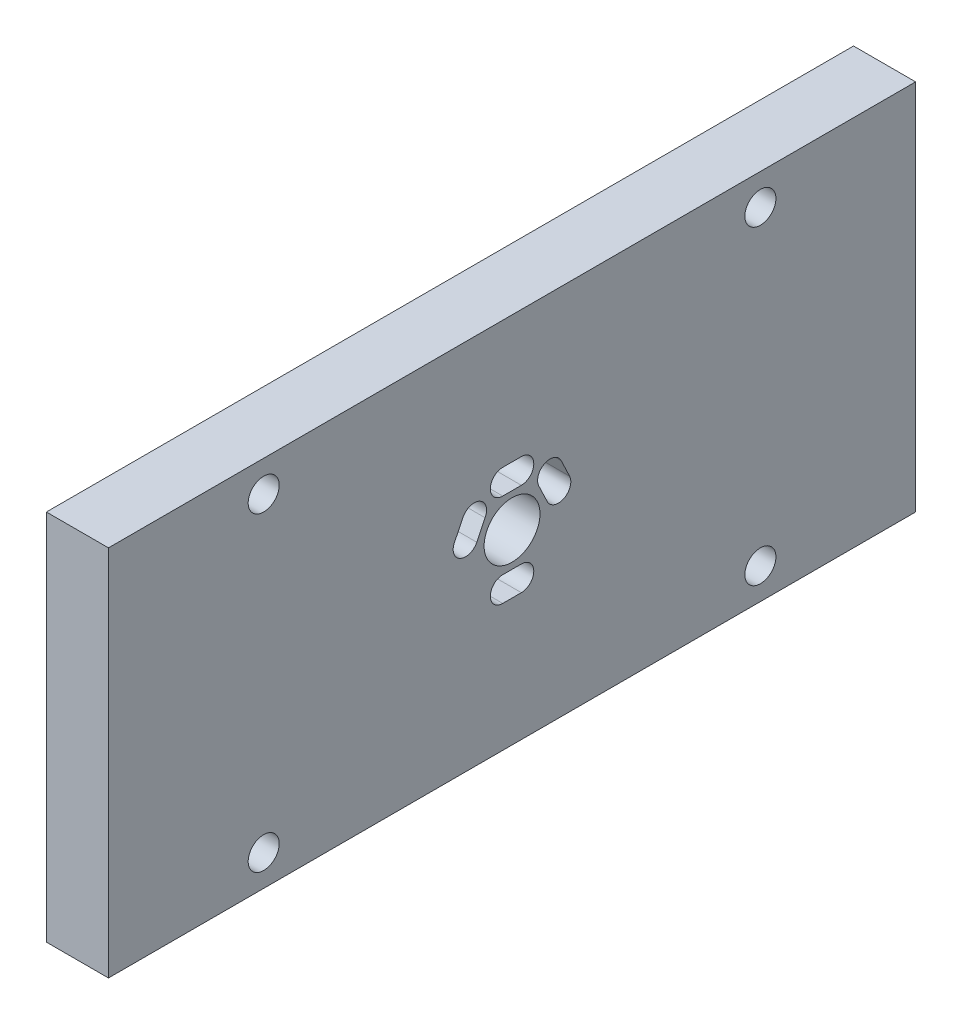
ISO-10303-21;
HEADER;
FILE_DESCRIPTION(('STEP AP214'),'2;1');
FILE_NAME('part.step','',(''),(''),'','','');
FILE_SCHEMA(('AUTOMOTIVE_DESIGN { 1 0 10303 214 1 1 1 1 }'));
ENDSEC;
DATA;
#1=APPLICATION_CONTEXT('core data for automotive mechanical design processes');
#2=APPLICATION_PROTOCOL_DEFINITION('international standard','automotive_design',2000,#1);
#3=PRODUCT_CONTEXT('',#1,'mechanical');
#4=PRODUCT('Part','Part','',(#3));
#5=PRODUCT_RELATED_PRODUCT_CATEGORY('part','',(#4));
#6=PRODUCT_DEFINITION_FORMATION('','',#4);
#7=PRODUCT_DEFINITION_CONTEXT('part definition',#1,'design');
#8=PRODUCT_DEFINITION('design','',#6,#7);
#9=PRODUCT_DEFINITION_SHAPE('','',#8);
#10=(LENGTH_UNIT() NAMED_UNIT(*) SI_UNIT(.MILLI.,.METRE.));
#11=(NAMED_UNIT(*) PLANE_ANGLE_UNIT() SI_UNIT($,.RADIAN.));
#12=(NAMED_UNIT(*) SI_UNIT($,.STERADIAN.) SOLID_ANGLE_UNIT());
#13=UNCERTAINTY_MEASURE_WITH_UNIT(LENGTH_MEASURE(1.E-05),#10,'distance_accuracy_value','');
#14=(GEOMETRIC_REPRESENTATION_CONTEXT(3) GLOBAL_UNCERTAINTY_ASSIGNED_CONTEXT((#13)) GLOBAL_UNIT_ASSIGNED_CONTEXT((#10,
#11,#12)) REPRESENTATION_CONTEXT('',''));
#15=CARTESIAN_POINT('',(0.,0.,0.));
#16=DIRECTION('',(0.,0.,1.));
#17=DIRECTION('',(1.,0.,0.));
#18=AXIS2_PLACEMENT_3D('',#15,#16,#17);
#19=CARTESIAN_POINT('',(10.,0.,0.));
#20=DIRECTION('',(1.,0.,0.));
#21=DIRECTION('',(0.,0.,-1.));
#22=AXIS2_PLACEMENT_3D('',#19,#20,#21);
#23=PLANE('',#22);
#24=DIRECTION('',(0.,0.902649656090385,0.430376112673449));
#25=VECTOR('',#24,1.);
#26=CARTESIAN_POINT('',(10.,33.5893000538088,-11.7336326254633));
#27=LINE('',#26,#25);
#28=CARTESIAN_POINT('',(10.,30.7583147353488,-13.0834237079433));
#29=VERTEX_POINT('',#28);
#30=CARTESIAN_POINT('',(10.,33.5893000538088,-11.7336326254633));
#31=VERTEX_POINT('',#30);
#32=EDGE_CURVE('E177',#29,#31,#27,.T.);
#33=ORIENTED_EDGE('',*,*,#32,.F.);
#34=CARTESIAN_POINT('',(10.,29.8982601486518,-11.277710689953));
#35=DIRECTION('',(1.,0.,0.));
#36=DIRECTION('',(0.,0.,-1.));
#37=AXIS2_PLACEMENT_3D('',#34,#35,#36);
#38=CIRCLE('',#37,2.00007334751453);
#39=CARTESIAN_POINT('',(10.,29.0382055619547,-9.47199767196282));
#40=VERTEX_POINT('',#39);
#41=EDGE_CURVE('E169',#40,#29,#38,.T.);
#42=ORIENTED_EDGE('',*,*,#41,.F.);
#43=DIRECTION('',(0.,-0.902996994662955,-0.429646863865747));
#44=VECTOR('',#43,1.);
#45=CARTESIAN_POINT('',(10.,29.0382055619547,-9.47199767196282));
#46=LINE('',#45,#44);
#47=CARTESIAN_POINT('',(10.,31.9615961769347,-8.08104552372279));
#48=VERTEX_POINT('',#47);
#49=EDGE_CURVE('E192',#48,#40,#46,.T.);
#50=ORIENTED_EDGE('',*,*,#49,.F.);
#51=CARTESIAN_POINT('',(10.,32.7289545054334,-9.92805804091433));
#52=DIRECTION('',(1.,0.,0.));
#53=DIRECTION('',(0.,0.,-1.));
#54=AXIS2_PLACEMENT_3D('',#51,#52,#53);
#55=CIRCLE('',#54,2.00007350939372);
#56=EDGE_CURVE('E190',#31,#48,#55,.T.);
#57=ORIENTED_EDGE('',*,*,#56,.F.);
#58=EDGE_LOOP('',(#33,#42,#50,#57));
#59=FACE_BOUND('',#58,.T.);
#60=DIRECTION('',(0.,0.,1.));
#61=VECTOR('',#60,1.);
#62=CARTESIAN_POINT('',(10.,22.3975308727947,-2.3131607907828));
#63=LINE('',#62,#61);
#64=CARTESIAN_POINT('',(10.,22.3975308727947,-5.31316079026278));
#65=VERTEX_POINT('',#64);
#66=CARTESIAN_POINT('',(10.,22.3975308727947,-2.3131607907828));
#67=VERTEX_POINT('',#66);
#68=EDGE_CURVE('E241',#65,#67,#63,.T.);
#69=ORIENTED_EDGE('',*,*,#68,.F.);
#70=CARTESIAN_POINT('',(10.,20.3975308735647,-5.31316079026278));
#71=DIRECTION('',(1.,0.,0.));
#72=DIRECTION('',(0.,0.,-1.));
#73=AXIS2_PLACEMENT_3D('',#70,#71,#72);
#74=CIRCLE('',#73,1.99999999922999);
#75=CARTESIAN_POINT('',(10.,18.3975308743347,-5.31316079026278));
#76=VERTEX_POINT('',#75);
#77=EDGE_CURVE('E239',#76,#65,#74,.T.);
#78=ORIENTED_EDGE('',*,*,#77,.F.);
#79=DIRECTION('',(0.,0.,-1.));
#80=VECTOR('',#79,1.);
#81=CARTESIAN_POINT('',(10.,18.3975308743347,-5.31316079026278));
#82=LINE('',#81,#80);
#83=CARTESIAN_POINT('',(10.,18.3975308743347,-2.3131607907828));
#84=VERTEX_POINT('',#83);
#85=EDGE_CURVE('E247',#84,#76,#82,.T.);
#86=ORIENTED_EDGE('',*,*,#85,.F.);
#87=CARTESIAN_POINT('',(10.,20.3975308735647,-2.3131607907828));
#88=DIRECTION('',(1.,0.,0.));
#89=DIRECTION('',(0.,0.,-1.));
#90=AXIS2_PLACEMENT_3D('',#87,#88,#89);
#91=CIRCLE('',#90,1.99999999922999);
#92=EDGE_CURVE('E244',#67,#84,#91,.T.);
#93=ORIENTED_EDGE('',*,*,#92,.F.);
#94=EDGE_LOOP('',(#69,#78,#86,#93));
#95=FACE_BOUND('',#94,.T.);
#96=CARTESIAN_POINT('',(10.,52.8975308735347,-43.8131607905228));
#97=DIRECTION('',(1.,0.,0.));
#98=DIRECTION('',(0.,0.,-1.));
#99=AXIS2_PLACEMENT_3D('',#96,#97,#98);
#100=CIRCLE('',#99,2.5);
#101=CARTESIAN_POINT('',(10.,52.8975308735347,-46.3131607905228));
#102=VERTEX_POINT('',#101);
#103=EDGE_CURVE('E301',#102,#102,#100,.T.);
#104=ORIENTED_EDGE('',*,*,#103,.F.);
#105=EDGE_LOOP('',(#104));
#106=FACE_BOUND('',#105,.T.);
#107=CARTESIAN_POINT('',(10.,2.89753087353471,36.1868392094772));
#108=DIRECTION('',(1.,0.,0.));
#109=DIRECTION('',(0.,0.,-1.));
#110=AXIS2_PLACEMENT_3D('',#107,#108,#109);
#111=CIRCLE('',#110,2.5);
#112=CARTESIAN_POINT('',(10.,2.89753087353471,33.6868392094772));
#113=VERTEX_POINT('',#112);
#114=EDGE_CURVE('E313',#113,#113,#111,.T.);
#115=ORIENTED_EDGE('',*,*,#114,.F.);
#116=EDGE_LOOP('',(#115));
#117=FACE_BOUND('',#116,.T.);
#118=DIRECTION('',(0.,-1.,0.));
#119=VECTOR('',#118,1.);
#120=CARTESIAN_POINT('',(10.,57.8975308735347,61.1868392094772));
#121=LINE('',#120,#119);
#122=CARTESIAN_POINT('',(10.,57.8975308735347,61.1868392094772));
#123=VERTEX_POINT('',#122);
#124=CARTESIAN_POINT('',(10.,-2.10246912646529,61.1868392094772));
#125=VERTEX_POINT('',#124);
#126=EDGE_CURVE('E325',#123,#125,#121,.T.);
#127=ORIENTED_EDGE('',*,*,#126,.T.);
#128=DIRECTION('',(0.,0.,-1.));
#129=VECTOR('',#128,1.);
#130=CARTESIAN_POINT('',(10.,-2.10246912646529,61.1868392094772));
#131=LINE('',#130,#129);
#132=CARTESIAN_POINT('',(10.,-2.10246912646529,-68.8131607905228));
#133=VERTEX_POINT('',#132);
#134=EDGE_CURVE('E328',#125,#133,#131,.T.);
#135=ORIENTED_EDGE('',*,*,#134,.T.);
#136=DIRECTION('',(0.,1.,0.));
#137=VECTOR('',#136,1.);
#138=CARTESIAN_POINT('',(10.,57.8975308735347,-68.8131607905228));
#139=LINE('',#138,#137);
#140=CARTESIAN_POINT('',(10.,57.8975308735347,-68.8131607905228));
#141=VERTEX_POINT('',#140);
#142=EDGE_CURVE('E331',#133,#141,#139,.T.);
#143=ORIENTED_EDGE('',*,*,#142,.T.);
#144=DIRECTION('',(0.,0.,1.));
#145=VECTOR('',#144,1.);
#146=CARTESIAN_POINT('',(10.,57.8975308735347,61.1868392094772));
#147=LINE('',#146,#145);
#148=EDGE_CURVE('E333',#141,#123,#147,.T.);
#149=ORIENTED_EDGE('',*,*,#148,.T.);
#150=EDGE_LOOP('',(#127,#135,#143,#149));
#151=FACE_BOUND('',#150,.T.);
#152=CARTESIAN_POINT('',(10.,52.8975308735347,36.1868392094772));
#153=DIRECTION('',(1.,0.,0.));
#154=DIRECTION('',(0.,0.,-1.));
#155=AXIS2_PLACEMENT_3D('',#152,#153,#154);
#156=CIRCLE('',#155,2.5);
#157=CARTESIAN_POINT('',(10.,52.8975308735347,33.6868392094772));
#158=VERTEX_POINT('',#157);
#159=EDGE_CURVE('E319',#158,#158,#156,.T.);
#160=ORIENTED_EDGE('',*,*,#159,.F.);
#161=EDGE_LOOP('',(#160));
#162=FACE_BOUND('',#161,.T.);
#163=CARTESIAN_POINT('',(10.,2.89753087353471,-43.8131607905228));
#164=DIRECTION('',(1.,0.,0.));
#165=DIRECTION('',(0.,0.,-1.));
#166=AXIS2_PLACEMENT_3D('',#163,#164,#165);
#167=CIRCLE('',#166,2.5);
#168=CARTESIAN_POINT('',(10.,2.89753087353471,-46.3131607905228));
#169=VERTEX_POINT('',#168);
#170=EDGE_CURVE('E307',#169,#169,#167,.T.);
#171=ORIENTED_EDGE('',*,*,#170,.F.);
#172=EDGE_LOOP('',(#171));
#173=FACE_BOUND('',#172,.T.);
#174=DIRECTION('',(0.,0.898794046520824,-0.438371146334613));
#175=VECTOR('',#174,1.);
#176=CARTESIAN_POINT('',(10.,31.7705559468743,0.528409533177395));
#177=LINE('',#176,#175);
#178=CARTESIAN_POINT('',(10.,29.0207563563143,1.86957640379742));
#179=VERTEX_POINT('',#178);
#180=CARTESIAN_POINT('',(10.,31.7705559468743,0.528409533177395));
#181=VERTEX_POINT('',#180);
#182=EDGE_CURVE('E272',#179,#181,#177,.T.);
#183=ORIENTED_EDGE('',*,*,#182,.F.);
#184=CARTESIAN_POINT('',(10.,29.8975308736699,3.66723056745029));
#185=DIRECTION('',(1.,0.,0.));
#186=DIRECTION('',(0.,0.,-1.));
#187=AXIS2_PLACEMENT_3D('',#184,#185,#186);
#188=CIRCLE('',#187,2.00007351024472);
#189=CARTESIAN_POINT('',(10.,30.7753413256747,5.46437910241722));
#190=VERTEX_POINT('',#189);
#191=EDGE_CURVE('E270',#190,#179,#188,.T.);
#192=ORIENTED_EDGE('',*,*,#191,.F.);
#193=DIRECTION('',(0.,-0.898541241299696,0.438889094970019));
#194=VECTOR('',#193,1.);
#195=CARTESIAN_POINT('',(10.,30.7753413256747,5.46437910241722));
#196=LINE('',#195,#194);
#197=CARTESIAN_POINT('',(10.,33.6063050236547,4.08160551541721));
#198=VERTEX_POINT('',#197);
#199=EDGE_CURVE('E278',#198,#190,#196,.T.);
#200=ORIENTED_EDGE('',*,*,#199,.F.);
#201=CARTESIAN_POINT('',(10.,32.7228387875237,2.28723056816493));
#202=DIRECTION('',(1.,0.,0.));
#203=DIRECTION('',(0.,0.,-1.));
#204=AXIS2_PLACEMENT_3D('',#201,#202,#203);
#205=CIRCLE('',#204,2.0000735090766);
#206=EDGE_CURVE('E275',#181,#198,#205,.T.);
#207=ORIENTED_EDGE('',*,*,#206,.F.);
#208=EDGE_LOOP('',(#183,#192,#200,#207));
#209=FACE_BOUND('',#208,.T.);
#210=DIRECTION('',(0.,0.,1.));
#211=VECTOR('',#210,1.);
#212=CARTESIAN_POINT('',(10.,37.3742487653747,-2.3131607907828));
#213=LINE('',#212,#211);
#214=CARTESIAN_POINT('',(10.,37.3742487653747,-5.31316079026278));
#215=VERTEX_POINT('',#214);
#216=CARTESIAN_POINT('',(10.,37.3742487653747,-2.3131607907828));
#217=VERTEX_POINT('',#216);
#218=EDGE_CURVE('E210',#215,#217,#213,.T.);
#219=ORIENTED_EDGE('',*,*,#218,.F.);
#220=CARTESIAN_POINT('',(10.,35.3742487648747,-5.31316079026278));
#221=DIRECTION('',(1.,0.,0.));
#222=DIRECTION('',(0.,0.,-1.));
#223=AXIS2_PLACEMENT_3D('',#220,#221,#222);
#224=CIRCLE('',#223,2.0000000005);
#225=CARTESIAN_POINT('',(10.,33.3742487643747,-5.31316079026278));
#226=VERTEX_POINT('',#225);
#227=EDGE_CURVE('E208',#226,#215,#224,.T.);
#228=ORIENTED_EDGE('',*,*,#227,.F.);
#229=DIRECTION('',(0.,0.,-1.));
#230=VECTOR('',#229,1.);
#231=CARTESIAN_POINT('',(10.,33.3742487643747,-5.31316079026278));
#232=LINE('',#231,#230);
#233=CARTESIAN_POINT('',(10.,33.3742487643747,-2.3131607907828));
#234=VERTEX_POINT('',#233);
#235=EDGE_CURVE('E216',#234,#226,#232,.T.);
#236=ORIENTED_EDGE('',*,*,#235,.F.);
#237=CARTESIAN_POINT('',(10.,35.3742487648747,-2.3131607907828));
#238=DIRECTION('',(1.,0.,0.));
#239=DIRECTION('',(0.,0.,-1.));
#240=AXIS2_PLACEMENT_3D('',#237,#238,#239);
#241=CIRCLE('',#240,2.0000000005);
#242=EDGE_CURVE('E213',#217,#234,#241,.T.);
#243=ORIENTED_EDGE('',*,*,#242,.F.);
#244=EDGE_LOOP('',(#219,#228,#236,#243));
#245=FACE_BOUND('',#244,.T.);
#246=CARTESIAN_POINT('',(10.,27.8975308735347,-3.81316079052279));
#247=DIRECTION('',(1.,0.,0.));
#248=DIRECTION('',(0.,0.,-1.));
#249=AXIS2_PLACEMENT_3D('',#246,#247,#248);
#250=CIRCLE('',#249,4.49999999921999);
#251=CARTESIAN_POINT('',(10.,27.8975308735347,-8.31316078974278));
#252=VERTEX_POINT('',#251);
#253=EDGE_CURVE('E198',#252,#252,#250,.T.);
#254=ORIENTED_EDGE('',*,*,#253,.F.);
#255=EDGE_LOOP('',(#254));
#256=FACE_BOUND('',#255,.T.);
#257=ADVANCED_FACE('F32',(#59,#95,#106,#117,#151,#162,#173,#209,#245,#256),#23,.T.);
#258=CARTESIAN_POINT('',(0.,0.,0.));
#259=DIRECTION('',(1.,0.,0.));
#260=DIRECTION('',(0.,0.,-1.));
#261=AXIS2_PLACEMENT_3D('',#258,#259,#260);
#262=PLANE('',#261);
#263=CARTESIAN_POINT('',(0.,29.8982601486518,-11.277710689953));
#264=DIRECTION('',(1.,0.,0.));
#265=DIRECTION('',(0.,0.,-1.));
#266=AXIS2_PLACEMENT_3D('',#263,#264,#265);
#267=CIRCLE('',#266,2.00007334751453);
#268=CARTESIAN_POINT('',(0.,29.0382055619547,-9.47199767196282));
#269=VERTEX_POINT('',#268);
#270=CARTESIAN_POINT('',(0.,30.7583147353488,-13.0834237079433));
#271=VERTEX_POINT('',#270);
#272=EDGE_CURVE('E55',#269,#271,#267,.T.);
#273=ORIENTED_EDGE('',*,*,#272,.T.);
#274=DIRECTION('',(0.,0.902649656090385,0.430376112673449));
#275=VECTOR('',#274,1.);
#276=CARTESIAN_POINT('',(0.,33.5893000538088,-11.7336326254633));
#277=LINE('',#276,#275);
#278=CARTESIAN_POINT('',(0.,33.5893000538088,-11.7336326254633));
#279=VERTEX_POINT('',#278);
#280=EDGE_CURVE('E184',#271,#279,#277,.T.);
#281=ORIENTED_EDGE('',*,*,#280,.T.);
#282=CARTESIAN_POINT('',(0.,32.7289545054334,-9.92805804091433));
#283=DIRECTION('',(1.,0.,0.));
#284=DIRECTION('',(0.,0.,-1.));
#285=AXIS2_PLACEMENT_3D('',#282,#283,#284);
#286=CIRCLE('',#285,2.00007350939372);
#287=CARTESIAN_POINT('',(0.,31.9615961769347,-8.08104552372279));
#288=VERTEX_POINT('',#287);
#289=EDGE_CURVE('E200',#279,#288,#286,.T.);
#290=ORIENTED_EDGE('',*,*,#289,.T.);
#291=DIRECTION('',(0.,-0.902996994662955,-0.429646863865747));
#292=VECTOR('',#291,1.);
#293=CARTESIAN_POINT('',(0.,29.0382055619547,-9.47199767196282));
#294=LINE('',#293,#292);
#295=EDGE_CURVE('E178',#288,#269,#294,.T.);
#296=ORIENTED_EDGE('',*,*,#295,.T.);
#297=EDGE_LOOP('',(#273,#281,#290,#296));
#298=FACE_BOUND('',#297,.T.);
#299=CARTESIAN_POINT('',(0.,20.3975308735647,-5.31316079026278));
#300=DIRECTION('',(1.,0.,0.));
#301=DIRECTION('',(0.,0.,-1.));
#302=AXIS2_PLACEMENT_3D('',#299,#300,#301);
#303=CIRCLE('',#302,1.99999999922999);
#304=CARTESIAN_POINT('',(0.,18.3975308743347,-5.31316079026278));
#305=VERTEX_POINT('',#304);
#306=CARTESIAN_POINT('',(0.,22.3975308727947,-5.31316079026278));
#307=VERTEX_POINT('',#306);
#308=EDGE_CURVE('E238',#305,#307,#303,.T.);
#309=ORIENTED_EDGE('',*,*,#308,.T.);
#310=DIRECTION('',(0.,0.,1.));
#311=VECTOR('',#310,1.);
#312=CARTESIAN_POINT('',(0.,22.3975308727947,-2.3131607907828));
#313=LINE('',#312,#311);
#314=CARTESIAN_POINT('',(0.,22.3975308727947,-2.3131607907828));
#315=VERTEX_POINT('',#314);
#316=EDGE_CURVE('E252',#307,#315,#313,.T.);
#317=ORIENTED_EDGE('',*,*,#316,.T.);
#318=CARTESIAN_POINT('',(0.,20.3975308735647,-2.3131607907828));
#319=DIRECTION('',(1.,0.,0.));
#320=DIRECTION('',(0.,0.,-1.));
#321=AXIS2_PLACEMENT_3D('',#318,#319,#320);
#322=CIRCLE('',#321,1.99999999922999);
#323=CARTESIAN_POINT('',(0.,18.3975308743347,-2.3131607907828));
#324=VERTEX_POINT('',#323);
#325=EDGE_CURVE('E255',#315,#324,#322,.T.);
#326=ORIENTED_EDGE('',*,*,#325,.T.);
#327=DIRECTION('',(0.,0.,-1.));
#328=VECTOR('',#327,1.);
#329=CARTESIAN_POINT('',(0.,18.3975308743347,-5.31316079026278));
#330=LINE('',#329,#328);
#331=EDGE_CURVE('E242',#324,#305,#330,.T.);
#332=ORIENTED_EDGE('',*,*,#331,.T.);
#333=EDGE_LOOP('',(#309,#317,#326,#332));
#334=FACE_BOUND('',#333,.T.);
#335=CARTESIAN_POINT('',(0.,52.8975308735347,-43.8131607905228));
#336=DIRECTION('',(1.,0.,0.));
#337=DIRECTION('',(0.,0.,-1.));
#338=AXIS2_PLACEMENT_3D('',#335,#336,#337);
#339=CIRCLE('',#338,2.5);
#340=CARTESIAN_POINT('',(0.,52.8975308735347,-46.3131607905228));
#341=VERTEX_POINT('',#340);
#342=EDGE_CURVE('E300',#341,#341,#339,.T.);
#343=ORIENTED_EDGE('',*,*,#342,.T.);
#344=EDGE_LOOP('',(#343));
#345=FACE_BOUND('',#344,.T.);
#346=CARTESIAN_POINT('',(0.,2.89753087353471,36.1868392094772));
#347=DIRECTION('',(1.,0.,0.));
#348=DIRECTION('',(0.,0.,-1.));
#349=AXIS2_PLACEMENT_3D('',#346,#347,#348);
#350=CIRCLE('',#349,2.5);
#351=CARTESIAN_POINT('',(0.,2.89753087353471,33.6868392094772));
#352=VERTEX_POINT('',#351);
#353=EDGE_CURVE('E310',#352,#352,#350,.T.);
#354=ORIENTED_EDGE('',*,*,#353,.T.);
#355=EDGE_LOOP('',(#354));
#356=FACE_BOUND('',#355,.T.);
#357=DIRECTION('',(0.,-1.,0.));
#358=VECTOR('',#357,1.);
#359=CARTESIAN_POINT('',(0.,57.8975308735347,61.1868392094772));
#360=LINE('',#359,#358);
#361=CARTESIAN_POINT('',(0.,57.8975308735347,61.1868392094772));
#362=VERTEX_POINT('',#361);
#363=CARTESIAN_POINT('',(0.,-2.10246912646529,61.1868392094772));
#364=VERTEX_POINT('',#363);
#365=EDGE_CURVE('E322',#362,#364,#360,.T.);
#366=ORIENTED_EDGE('',*,*,#365,.F.);
#367=DIRECTION('',(0.,0.,1.));
#368=VECTOR('',#367,1.);
#369=CARTESIAN_POINT('',(0.,57.8975308735347,61.1868392094772));
#370=LINE('',#369,#368);
#371=CARTESIAN_POINT('',(0.,57.8975308735347,-68.8131607905228));
#372=VERTEX_POINT('',#371);
#373=EDGE_CURVE('E329',#372,#362,#370,.T.);
#374=ORIENTED_EDGE('',*,*,#373,.F.);
#375=DIRECTION('',(0.,1.,0.));
#376=VECTOR('',#375,1.);
#377=CARTESIAN_POINT('',(0.,57.8975308735347,-68.8131607905228));
#378=LINE('',#377,#376);
#379=CARTESIAN_POINT('',(0.,-2.10246912646529,-68.8131607905228));
#380=VERTEX_POINT('',#379);
#381=EDGE_CURVE('E340',#380,#372,#378,.T.);
#382=ORIENTED_EDGE('',*,*,#381,.F.);
#383=DIRECTION('',(0.,0.,-1.));
#384=VECTOR('',#383,1.);
#385=CARTESIAN_POINT('',(0.,-2.10246912646529,61.1868392094772));
#386=LINE('',#385,#384);
#387=EDGE_CURVE('E338',#364,#380,#386,.T.);
#388=ORIENTED_EDGE('',*,*,#387,.F.);
#389=EDGE_LOOP('',(#366,#374,#382,#388));
#390=FACE_BOUND('',#389,.T.);
#391=CARTESIAN_POINT('',(0.,52.8975308735347,36.1868392094772));
#392=DIRECTION('',(1.,0.,0.));
#393=DIRECTION('',(0.,0.,-1.));
#394=AXIS2_PLACEMENT_3D('',#391,#392,#393);
#395=CIRCLE('',#394,2.5);
#396=CARTESIAN_POINT('',(0.,52.8975308735347,33.6868392094772));
#397=VERTEX_POINT('',#396);
#398=EDGE_CURVE('E316',#397,#397,#395,.T.);
#399=ORIENTED_EDGE('',*,*,#398,.T.);
#400=EDGE_LOOP('',(#399));
#401=FACE_BOUND('',#400,.T.);
#402=CARTESIAN_POINT('',(0.,2.89753087353471,-43.8131607905228));
#403=DIRECTION('',(1.,0.,0.));
#404=DIRECTION('',(0.,0.,-1.));
#405=AXIS2_PLACEMENT_3D('',#402,#403,#404);
#406=CIRCLE('',#405,2.5);
#407=CARTESIAN_POINT('',(0.,2.89753087353471,-46.3131607905228));
#408=VERTEX_POINT('',#407);
#409=EDGE_CURVE('E304',#408,#408,#406,.T.);
#410=ORIENTED_EDGE('',*,*,#409,.T.);
#411=EDGE_LOOP('',(#410));
#412=FACE_BOUND('',#411,.T.);
#413=CARTESIAN_POINT('',(0.,29.8975308736699,3.66723056745029));
#414=DIRECTION('',(1.,0.,0.));
#415=DIRECTION('',(0.,0.,-1.));
#416=AXIS2_PLACEMENT_3D('',#413,#414,#415);
#417=CIRCLE('',#416,2.00007351024472);
#418=CARTESIAN_POINT('',(0.,30.7753413256747,5.46437910241722));
#419=VERTEX_POINT('',#418);
#420=CARTESIAN_POINT('',(0.,29.0207563563143,1.86957640379742));
#421=VERTEX_POINT('',#420);
#422=EDGE_CURVE('E269',#419,#421,#417,.T.);
#423=ORIENTED_EDGE('',*,*,#422,.T.);
#424=DIRECTION('',(0.,0.898794046520824,-0.438371146334613));
#425=VECTOR('',#424,1.);
#426=CARTESIAN_POINT('',(0.,31.7705559468743,0.528409533177395));
#427=LINE('',#426,#425);
#428=CARTESIAN_POINT('',(0.,31.7705559468743,0.528409533177395));
#429=VERTEX_POINT('',#428);
#430=EDGE_CURVE('E283',#421,#429,#427,.T.);
#431=ORIENTED_EDGE('',*,*,#430,.T.);
#432=CARTESIAN_POINT('',(0.,32.7228387875237,2.28723056816493));
#433=DIRECTION('',(1.,0.,0.));
#434=DIRECTION('',(0.,0.,-1.));
#435=AXIS2_PLACEMENT_3D('',#432,#433,#434);
#436=CIRCLE('',#435,2.0000735090766);
#437=CARTESIAN_POINT('',(0.,33.6063050236547,4.08160551541721));
#438=VERTEX_POINT('',#437);
#439=EDGE_CURVE('E286',#429,#438,#436,.T.);
#440=ORIENTED_EDGE('',*,*,#439,.T.);
#441=DIRECTION('',(0.,-0.898541241299696,0.438889094970019));
#442=VECTOR('',#441,1.);
#443=CARTESIAN_POINT('',(0.,30.7753413256747,5.46437910241722));
#444=LINE('',#443,#442);
#445=EDGE_CURVE('E273',#438,#419,#444,.T.);
#446=ORIENTED_EDGE('',*,*,#445,.T.);
#447=EDGE_LOOP('',(#423,#431,#440,#446));
#448=FACE_BOUND('',#447,.T.);
#449=CARTESIAN_POINT('',(0.,35.3742487648747,-5.31316079026278));
#450=DIRECTION('',(1.,0.,0.));
#451=DIRECTION('',(0.,0.,-1.));
#452=AXIS2_PLACEMENT_3D('',#449,#450,#451);
#453=CIRCLE('',#452,2.0000000005);
#454=CARTESIAN_POINT('',(0.,33.3742487643747,-5.31316079026278));
#455=VERTEX_POINT('',#454);
#456=CARTESIAN_POINT('',(0.,37.3742487653747,-5.31316079026278));
#457=VERTEX_POINT('',#456);
#458=EDGE_CURVE('E185',#455,#457,#453,.T.);
#459=ORIENTED_EDGE('',*,*,#458,.T.);
#460=DIRECTION('',(0.,0.,1.));
#461=VECTOR('',#460,1.);
#462=CARTESIAN_POINT('',(0.,37.3742487653747,-2.3131607907828));
#463=LINE('',#462,#461);
#464=CARTESIAN_POINT('',(0.,37.3742487653747,-2.3131607907828));
#465=VERTEX_POINT('',#464);
#466=EDGE_CURVE('E221',#457,#465,#463,.T.);
#467=ORIENTED_EDGE('',*,*,#466,.T.);
#468=CARTESIAN_POINT('',(0.,35.3742487648747,-2.3131607907828));
#469=DIRECTION('',(1.,0.,0.));
#470=DIRECTION('',(0.,0.,-1.));
#471=AXIS2_PLACEMENT_3D('',#468,#469,#470);
#472=CIRCLE('',#471,2.0000000005);
#473=CARTESIAN_POINT('',(0.,33.3742487643747,-2.3131607907828));
#474=VERTEX_POINT('',#473);
#475=EDGE_CURVE('E224',#465,#474,#472,.T.);
#476=ORIENTED_EDGE('',*,*,#475,.T.);
#477=DIRECTION('',(0.,0.,-1.));
#478=VECTOR('',#477,1.);
#479=CARTESIAN_POINT('',(0.,33.3742487643747,-5.31316079026278));
#480=LINE('',#479,#478);
#481=EDGE_CURVE('E211',#474,#455,#480,.T.);
#482=ORIENTED_EDGE('',*,*,#481,.T.);
#483=EDGE_LOOP('',(#459,#467,#476,#482));
#484=FACE_BOUND('',#483,.T.);
#485=CARTESIAN_POINT('',(0.,27.8975308735347,-3.81316079052279));
#486=DIRECTION('',(1.,0.,0.));
#487=DIRECTION('',(0.,0.,-1.));
#488=AXIS2_PLACEMENT_3D('',#485,#486,#487);
#489=CIRCLE('',#488,4.49999999921999);
#490=CARTESIAN_POINT('',(0.,27.8975308735347,-8.31316078974278));
#491=VERTEX_POINT('',#490);
#492=EDGE_CURVE('E408',#491,#491,#489,.T.);
#493=ORIENTED_EDGE('',*,*,#492,.T.);
#494=EDGE_LOOP('',(#493));
#495=FACE_BOUND('',#494,.T.);
#496=ADVANCED_FACE('F358',(#298,#334,#345,#356,#390,#401,#412,#448,#484,#495),#262,.F.);
#497=CARTESIAN_POINT('',(10.,57.8975308735347,61.1868392094772));
#498=DIRECTION('',(0.,0.,-1.));
#499=DIRECTION('',(0.,1.,0.));
#500=AXIS2_PLACEMENT_3D('',#497,#498,#499);
#501=PLANE('',#500);
#502=ORIENTED_EDGE('',*,*,#365,.T.);
#503=DIRECTION('',(-1.,0.,0.));
#504=VECTOR('',#503,1.);
#505=CARTESIAN_POINT('',(10.,-2.10246912646529,61.1868392094772));
#506=LINE('',#505,#504);
#507=EDGE_CURVE('E11',#125,#364,#506,.T.);
#508=ORIENTED_EDGE('',*,*,#507,.F.);
#509=ORIENTED_EDGE('',*,*,#126,.F.);
#510=DIRECTION('',(-1.,0.,0.));
#511=VECTOR('',#510,1.);
#512=CARTESIAN_POINT('',(10.,57.8975308735347,61.1868392094772));
#513=LINE('',#512,#511);
#514=EDGE_CURVE('E335',#123,#362,#513,.T.);
#515=ORIENTED_EDGE('',*,*,#514,.T.);
#516=EDGE_LOOP('',(#502,#508,#509,#515));
#517=FACE_BOUND('',#516,.T.);
#518=ADVANCED_FACE('F34',(#517),#501,.F.);
#519=CARTESIAN_POINT('',(10.,-2.10246912646529,61.1868392094772));
#520=DIRECTION('',(0.,1.,0.));
#521=DIRECTION('',(0.,0.,1.));
#522=AXIS2_PLACEMENT_3D('',#519,#520,#521);
#523=PLANE('',#522);
#524=ORIENTED_EDGE('',*,*,#387,.T.);
#525=DIRECTION('',(-1.,0.,0.));
#526=VECTOR('',#525,1.);
#527=CARTESIAN_POINT('',(10.,-2.10246912646529,-68.8131607905228));
#528=LINE('',#527,#526);
#529=EDGE_CURVE('E40',#133,#380,#528,.T.);
#530=ORIENTED_EDGE('',*,*,#529,.F.);
#531=ORIENTED_EDGE('',*,*,#134,.F.);
#532=ORIENTED_EDGE('',*,*,#507,.T.);
#533=EDGE_LOOP('',(#524,#530,#531,#532));
#534=FACE_BOUND('',#533,.T.);
#535=ADVANCED_FACE('F369',(#534),#523,.F.);
#536=CARTESIAN_POINT('',(10.,57.8975308735347,-68.8131607905228));
#537=DIRECTION('',(0.,0.,1.));
#538=DIRECTION('',(1.,0.,0.));
#539=AXIS2_PLACEMENT_3D('',#536,#537,#538);
#540=PLANE('',#539);
#541=ORIENTED_EDGE('',*,*,#381,.T.);
#542=DIRECTION('',(-1.,0.,0.));
#543=VECTOR('',#542,1.);
#544=CARTESIAN_POINT('',(10.,57.8975308735347,-68.8131607905228));
#545=LINE('',#544,#543);
#546=EDGE_CURVE('E345',#141,#372,#545,.T.);
#547=ORIENTED_EDGE('',*,*,#546,.F.);
#548=ORIENTED_EDGE('',*,*,#142,.F.);
#549=ORIENTED_EDGE('',*,*,#529,.T.);
#550=EDGE_LOOP('',(#541,#547,#548,#549));
#551=FACE_BOUND('',#550,.T.);
#552=ADVANCED_FACE('F352',(#551),#540,.F.);
#553=CARTESIAN_POINT('',(10.,57.8975308735347,61.1868392094772));
#554=DIRECTION('',(0.,-1.,0.));
#555=DIRECTION('',(0.,0.,-1.));
#556=AXIS2_PLACEMENT_3D('',#553,#554,#555);
#557=PLANE('',#556);
#558=ORIENTED_EDGE('',*,*,#373,.T.);
#559=ORIENTED_EDGE('',*,*,#514,.F.);
#560=ORIENTED_EDGE('',*,*,#148,.F.);
#561=ORIENTED_EDGE('',*,*,#546,.T.);
#562=EDGE_LOOP('',(#558,#559,#560,#561));
#563=FACE_BOUND('',#562,.T.);
#564=ADVANCED_FACE('F362',(#563),#557,.F.);
#565=CARTESIAN_POINT('',(10.,52.8975308735347,36.1868392094772));
#566=DIRECTION('',(-1.,0.,0.));
#567=DIRECTION('',(0.,0.,1.));
#568=AXIS2_PLACEMENT_3D('',#565,#566,#567);
#569=CYLINDRICAL_SURFACE('',#568,2.5);
#570=ORIENTED_EDGE('',*,*,#159,.T.);
#571=EDGE_LOOP('',(#570));
#572=FACE_BOUND('',#571,.T.);
#573=ORIENTED_EDGE('',*,*,#398,.F.);
#574=EDGE_LOOP('',(#573));
#575=FACE_BOUND('',#574,.T.);
#576=ADVANCED_FACE('F384',(#572,#575),#569,.F.);
#577=CARTESIAN_POINT('',(10.,2.89753087353471,36.1868392094772));
#578=DIRECTION('',(-1.,0.,0.));
#579=DIRECTION('',(0.,0.,1.));
#580=AXIS2_PLACEMENT_3D('',#577,#578,#579);
#581=CYLINDRICAL_SURFACE('',#580,2.5);
#582=ORIENTED_EDGE('',*,*,#114,.T.);
#583=EDGE_LOOP('',(#582));
#584=FACE_BOUND('',#583,.T.);
#585=ORIENTED_EDGE('',*,*,#353,.F.);
#586=EDGE_LOOP('',(#585));
#587=FACE_BOUND('',#586,.T.);
#588=ADVANCED_FACE('F391',(#584,#587),#581,.F.);
#589=CARTESIAN_POINT('',(10.,2.89753087353471,-43.8131607905228));
#590=DIRECTION('',(-1.,0.,0.));
#591=DIRECTION('',(0.,0.,1.));
#592=AXIS2_PLACEMENT_3D('',#589,#590,#591);
#593=CYLINDRICAL_SURFACE('',#592,2.5);
#594=ORIENTED_EDGE('',*,*,#170,.T.);
#595=EDGE_LOOP('',(#594));
#596=FACE_BOUND('',#595,.T.);
#597=ORIENTED_EDGE('',*,*,#409,.F.);
#598=EDGE_LOOP('',(#597));
#599=FACE_BOUND('',#598,.T.);
#600=ADVANCED_FACE('F396',(#596,#599),#593,.F.);
#601=CARTESIAN_POINT('',(10.,52.8975308735347,-43.8131607905228));
#602=DIRECTION('',(-1.,0.,0.));
#603=DIRECTION('',(0.,0.,1.));
#604=AXIS2_PLACEMENT_3D('',#601,#602,#603);
#605=CYLINDRICAL_SURFACE('',#604,2.5);
#606=ORIENTED_EDGE('',*,*,#103,.T.);
#607=EDGE_LOOP('',(#606));
#608=FACE_BOUND('',#607,.T.);
#609=ORIENTED_EDGE('',*,*,#342,.F.);
#610=EDGE_LOOP('',(#609));
#611=FACE_BOUND('',#610,.T.);
#612=ADVANCED_FACE('F479',(#608,#611),#605,.F.);
#613=CARTESIAN_POINT('',(10.,29.8975308736699,3.66723056745029));
#614=DIRECTION('',(-1.,0.,0.));
#615=DIRECTION('',(0.,0.,1.));
#616=AXIS2_PLACEMENT_3D('',#613,#614,#615);
#617=CYLINDRICAL_SURFACE('',#616,2.00007351024472);
#618=ORIENTED_EDGE('',*,*,#422,.F.);
#619=DIRECTION('',(-1.,0.,0.));
#620=VECTOR('',#619,1.);
#621=CARTESIAN_POINT('',(10.,30.7753413256747,5.46437910241722));
#622=LINE('',#621,#620);
#623=EDGE_CURVE('E280',#190,#419,#622,.T.);
#624=ORIENTED_EDGE('',*,*,#623,.F.);
#625=ORIENTED_EDGE('',*,*,#191,.T.);
#626=DIRECTION('',(-1.,0.,0.));
#627=VECTOR('',#626,1.);
#628=CARTESIAN_POINT('',(10.,29.0207563563143,1.86957640379742));
#629=LINE('',#628,#627);
#630=EDGE_CURVE('E297',#179,#421,#629,.T.);
#631=ORIENTED_EDGE('',*,*,#630,.T.);
#632=EDGE_LOOP('',(#618,#624,#625,#631));
#633=FACE_BOUND('',#632,.T.);
#634=ADVANCED_FACE('F475',(#633),#617,.F.);
#635=CARTESIAN_POINT('',(10.,31.7705559468743,0.528409533177395));
#636=DIRECTION('',(0.,0.438371146334613,0.898794046520824));
#637=DIRECTION('',(0.,-0.898794046520824,0.438371146334613));
#638=AXIS2_PLACEMENT_3D('',#635,#636,#637);
#639=PLANE('',#638);
#640=ORIENTED_EDGE('',*,*,#430,.F.);
#641=ORIENTED_EDGE('',*,*,#630,.F.);
#642=ORIENTED_EDGE('',*,*,#182,.T.);
#643=DIRECTION('',(-1.,0.,0.));
#644=VECTOR('',#643,1.);
#645=CARTESIAN_POINT('',(10.,31.7705559468743,0.528409533177395));
#646=LINE('',#645,#644);
#647=EDGE_CURVE('E295',#181,#429,#646,.T.);
#648=ORIENTED_EDGE('',*,*,#647,.T.);
#649=EDGE_LOOP('',(#640,#641,#642,#648));
#650=FACE_BOUND('',#649,.T.);
#651=ADVANCED_FACE('F471',(#650),#639,.T.);
#652=CARTESIAN_POINT('',(10.,32.7228387875237,2.28723056816493));
#653=DIRECTION('',(-1.,0.,0.));
#654=DIRECTION('',(0.,0.,1.));
#655=AXIS2_PLACEMENT_3D('',#652,#653,#654);
#656=CYLINDRICAL_SURFACE('',#655,2.0000735090766);
#657=ORIENTED_EDGE('',*,*,#439,.F.);
#658=ORIENTED_EDGE('',*,*,#647,.F.);
#659=ORIENTED_EDGE('',*,*,#206,.T.);
#660=DIRECTION('',(-1.,0.,0.));
#661=VECTOR('',#660,1.);
#662=CARTESIAN_POINT('',(10.,33.6063050236547,4.08160551541721));
#663=LINE('',#662,#661);
#664=EDGE_CURVE('E293',#198,#438,#663,.T.);
#665=ORIENTED_EDGE('',*,*,#664,.T.);
#666=EDGE_LOOP('',(#657,#658,#659,#665));
#667=FACE_BOUND('',#666,.T.);
#668=ADVANCED_FACE('F467',(#667),#656,.F.);
#669=CARTESIAN_POINT('',(10.,30.7753413256747,5.46437910241722));
#670=DIRECTION('',(0.,-0.438889094970019,-0.898541241299696));
#671=DIRECTION('',(0.,0.898541241299696,-0.438889094970019));
#672=AXIS2_PLACEMENT_3D('',#669,#670,#671);
#673=PLANE('',#672);
#674=ORIENTED_EDGE('',*,*,#445,.F.);
#675=ORIENTED_EDGE('',*,*,#664,.F.);
#676=ORIENTED_EDGE('',*,*,#199,.T.);
#677=ORIENTED_EDGE('',*,*,#623,.T.);
#678=EDGE_LOOP('',(#674,#675,#676,#677));
#679=FACE_BOUND('',#678,.T.);
#680=ADVANCED_FACE('F463',(#679),#673,.T.);
#681=CARTESIAN_POINT('',(10.,20.3975308735647,-5.31316079026278));
#682=DIRECTION('',(-1.,0.,0.));
#683=DIRECTION('',(0.,0.,1.));
#684=AXIS2_PLACEMENT_3D('',#681,#682,#683);
#685=CYLINDRICAL_SURFACE('',#684,1.99999999922999);
#686=ORIENTED_EDGE('',*,*,#308,.F.);
#687=DIRECTION('',(-1.,0.,0.));
#688=VECTOR('',#687,1.);
#689=CARTESIAN_POINT('',(10.,18.3975308743347,-5.31316079026278));
#690=LINE('',#689,#688);
#691=EDGE_CURVE('E249',#76,#305,#690,.T.);
#692=ORIENTED_EDGE('',*,*,#691,.F.);
#693=ORIENTED_EDGE('',*,*,#77,.T.);
#694=DIRECTION('',(-1.,0.,0.));
#695=VECTOR('',#694,1.);
#696=CARTESIAN_POINT('',(10.,22.3975308727947,-5.31316079026278));
#697=LINE('',#696,#695);
#698=EDGE_CURVE('E266',#65,#307,#697,.T.);
#699=ORIENTED_EDGE('',*,*,#698,.T.);
#700=EDGE_LOOP('',(#686,#692,#693,#699));
#701=FACE_BOUND('',#700,.T.);
#702=ADVANCED_FACE('F459',(#701),#685,.F.);
#703=CARTESIAN_POINT('',(10.,22.3975308727947,-2.3131607907828));
#704=DIRECTION('',(0.,-1.,0.));
#705=DIRECTION('',(0.,0.,-1.));
#706=AXIS2_PLACEMENT_3D('',#703,#704,#705);
#707=PLANE('',#706);
#708=ORIENTED_EDGE('',*,*,#316,.F.);
#709=ORIENTED_EDGE('',*,*,#698,.F.);
#710=ORIENTED_EDGE('',*,*,#68,.T.);
#711=DIRECTION('',(-1.,0.,0.));
#712=VECTOR('',#711,1.);
#713=CARTESIAN_POINT('',(10.,22.3975308727947,-2.3131607907828));
#714=LINE('',#713,#712);
#715=EDGE_CURVE('E264',#67,#315,#714,.T.);
#716=ORIENTED_EDGE('',*,*,#715,.T.);
#717=EDGE_LOOP('',(#708,#709,#710,#716));
#718=FACE_BOUND('',#717,.T.);
#719=ADVANCED_FACE('F455',(#718),#707,.T.);
#720=CARTESIAN_POINT('',(10.,20.3975308735647,-2.3131607907828));
#721=DIRECTION('',(-1.,0.,0.));
#722=DIRECTION('',(0.,0.,1.));
#723=AXIS2_PLACEMENT_3D('',#720,#721,#722);
#724=CYLINDRICAL_SURFACE('',#723,1.99999999922999);
#725=ORIENTED_EDGE('',*,*,#325,.F.);
#726=ORIENTED_EDGE('',*,*,#715,.F.);
#727=ORIENTED_EDGE('',*,*,#92,.T.);
#728=DIRECTION('',(-1.,0.,0.));
#729=VECTOR('',#728,1.);
#730=CARTESIAN_POINT('',(10.,18.3975308743347,-2.3131607907828));
#731=LINE('',#730,#729);
#732=EDGE_CURVE('E262',#84,#324,#731,.T.);
#733=ORIENTED_EDGE('',*,*,#732,.T.);
#734=EDGE_LOOP('',(#725,#726,#727,#733));
#735=FACE_BOUND('',#734,.T.);
#736=ADVANCED_FACE('F451',(#735),#724,.F.);
#737=CARTESIAN_POINT('',(10.,18.3975308743347,-5.31316079026278));
#738=DIRECTION('',(0.,1.,0.));
#739=DIRECTION('',(0.,0.,1.));
#740=AXIS2_PLACEMENT_3D('',#737,#738,#739);
#741=PLANE('',#740);
#742=ORIENTED_EDGE('',*,*,#331,.F.);
#743=ORIENTED_EDGE('',*,*,#732,.F.);
#744=ORIENTED_EDGE('',*,*,#85,.T.);
#745=ORIENTED_EDGE('',*,*,#691,.T.);
#746=EDGE_LOOP('',(#742,#743,#744,#745));
#747=FACE_BOUND('',#746,.T.);
#748=ADVANCED_FACE('F447',(#747),#741,.T.);
#749=CARTESIAN_POINT('',(10.,35.3742487648747,-5.31316079026278));
#750=DIRECTION('',(-1.,0.,0.));
#751=DIRECTION('',(0.,0.,1.));
#752=AXIS2_PLACEMENT_3D('',#749,#750,#751);
#753=CYLINDRICAL_SURFACE('',#752,2.0000000005);
#754=ORIENTED_EDGE('',*,*,#458,.F.);
#755=DIRECTION('',(-1.,0.,0.));
#756=VECTOR('',#755,1.);
#757=CARTESIAN_POINT('',(10.,33.3742487643747,-5.31316079026278));
#758=LINE('',#757,#756);
#759=EDGE_CURVE('E218',#226,#455,#758,.T.);
#760=ORIENTED_EDGE('',*,*,#759,.F.);
#761=ORIENTED_EDGE('',*,*,#227,.T.);
#762=DIRECTION('',(-1.,0.,0.));
#763=VECTOR('',#762,1.);
#764=CARTESIAN_POINT('',(10.,37.3742487653747,-5.31316079026278));
#765=LINE('',#764,#763);
#766=EDGE_CURVE('E235',#215,#457,#765,.T.);
#767=ORIENTED_EDGE('',*,*,#766,.T.);
#768=EDGE_LOOP('',(#754,#760,#761,#767));
#769=FACE_BOUND('',#768,.T.);
#770=ADVANCED_FACE('F443',(#769),#753,.F.);
#771=CARTESIAN_POINT('',(10.,37.3742487653747,-2.3131607907828));
#772=DIRECTION('',(0.,-1.,0.));
#773=DIRECTION('',(0.,0.,-1.));
#774=AXIS2_PLACEMENT_3D('',#771,#772,#773);
#775=PLANE('',#774);
#776=ORIENTED_EDGE('',*,*,#466,.F.);
#777=ORIENTED_EDGE('',*,*,#766,.F.);
#778=ORIENTED_EDGE('',*,*,#218,.T.);
#779=DIRECTION('',(-1.,0.,0.));
#780=VECTOR('',#779,1.);
#781=CARTESIAN_POINT('',(10.,37.3742487653747,-2.3131607907828));
#782=LINE('',#781,#780);
#783=EDGE_CURVE('E233',#217,#465,#782,.T.);
#784=ORIENTED_EDGE('',*,*,#783,.T.);
#785=EDGE_LOOP('',(#776,#777,#778,#784));
#786=FACE_BOUND('',#785,.T.);
#787=ADVANCED_FACE('F439',(#786),#775,.T.);
#788=CARTESIAN_POINT('',(10.,35.3742487648747,-2.3131607907828));
#789=DIRECTION('',(-1.,0.,0.));
#790=DIRECTION('',(0.,0.,1.));
#791=AXIS2_PLACEMENT_3D('',#788,#789,#790);
#792=CYLINDRICAL_SURFACE('',#791,2.0000000005);
#793=ORIENTED_EDGE('',*,*,#475,.F.);
#794=ORIENTED_EDGE('',*,*,#783,.F.);
#795=ORIENTED_EDGE('',*,*,#242,.T.);
#796=DIRECTION('',(-1.,0.,0.));
#797=VECTOR('',#796,1.);
#798=CARTESIAN_POINT('',(10.,33.3742487643747,-2.3131607907828));
#799=LINE('',#798,#797);
#800=EDGE_CURVE('E231',#234,#474,#799,.T.);
#801=ORIENTED_EDGE('',*,*,#800,.T.);
#802=EDGE_LOOP('',(#793,#794,#795,#801));
#803=FACE_BOUND('',#802,.T.);
#804=ADVANCED_FACE('F435',(#803),#792,.F.);
#805=CARTESIAN_POINT('',(10.,33.3742487643747,-5.31316079026278));
#806=DIRECTION('',(0.,1.,0.));
#807=DIRECTION('',(0.,0.,1.));
#808=AXIS2_PLACEMENT_3D('',#805,#806,#807);
#809=PLANE('',#808);
#810=ORIENTED_EDGE('',*,*,#481,.F.);
#811=ORIENTED_EDGE('',*,*,#800,.F.);
#812=ORIENTED_EDGE('',*,*,#235,.T.);
#813=ORIENTED_EDGE('',*,*,#759,.T.);
#814=EDGE_LOOP('',(#810,#811,#812,#813));
#815=FACE_BOUND('',#814,.T.);
#816=ADVANCED_FACE('F432',(#815),#809,.T.);
#817=CARTESIAN_POINT('',(10.,29.8982601486518,-11.277710689953));
#818=DIRECTION('',(-1.,0.,0.));
#819=DIRECTION('',(0.,0.,1.));
#820=AXIS2_PLACEMENT_3D('',#817,#818,#819);
#821=CYLINDRICAL_SURFACE('',#820,2.00007334751453);
#822=ORIENTED_EDGE('',*,*,#272,.F.);
#823=DIRECTION('',(-1.,0.,0.));
#824=VECTOR('',#823,1.);
#825=CARTESIAN_POINT('',(10.,29.0382055619547,-9.47199767196282));
#826=LINE('',#825,#824);
#827=EDGE_CURVE('E173',#40,#269,#826,.T.);
#828=ORIENTED_EDGE('',*,*,#827,.F.);
#829=ORIENTED_EDGE('',*,*,#41,.T.);
#830=DIRECTION('',(-1.,0.,0.));
#831=VECTOR('',#830,1.);
#832=CARTESIAN_POINT('',(10.,30.7583147353488,-13.0834237079433));
#833=LINE('',#832,#831);
#834=EDGE_CURVE('E172',#29,#271,#833,.T.);
#835=ORIENTED_EDGE('',*,*,#834,.T.);
#836=EDGE_LOOP('',(#822,#828,#829,#835));
#837=FACE_BOUND('',#836,.T.);
#838=ADVANCED_FACE('F171',(#837),#821,.F.);
#839=CARTESIAN_POINT('',(10.,33.5893000538088,-11.7336326254633));
#840=DIRECTION('',(0.,-0.430376112673449,0.902649656090385));
#841=DIRECTION('',(0.,-0.902649656090385,-0.430376112673449));
#842=AXIS2_PLACEMENT_3D('',#839,#840,#841);
#843=PLANE('',#842);
#844=ORIENTED_EDGE('',*,*,#280,.F.);
#845=ORIENTED_EDGE('',*,*,#834,.F.);
#846=ORIENTED_EDGE('',*,*,#32,.T.);
#847=DIRECTION('',(-1.,0.,0.));
#848=VECTOR('',#847,1.);
#849=CARTESIAN_POINT('',(10.,33.5893000538088,-11.7336326254633));
#850=LINE('',#849,#848);
#851=EDGE_CURVE('E186',#31,#279,#850,.T.);
#852=ORIENTED_EDGE('',*,*,#851,.T.);
#853=EDGE_LOOP('',(#844,#845,#846,#852));
#854=FACE_BOUND('',#853,.T.);
#855=ADVANCED_FACE('F181',(#854),#843,.T.);
#856=CARTESIAN_POINT('',(10.,32.7289545054334,-9.92805804091433));
#857=DIRECTION('',(-1.,0.,0.));
#858=DIRECTION('',(0.,0.,1.));
#859=AXIS2_PLACEMENT_3D('',#856,#857,#858);
#860=CYLINDRICAL_SURFACE('',#859,2.00007350939372);
#861=ORIENTED_EDGE('',*,*,#289,.F.);
#862=ORIENTED_EDGE('',*,*,#851,.F.);
#863=ORIENTED_EDGE('',*,*,#56,.T.);
#864=DIRECTION('',(-1.,0.,0.));
#865=VECTOR('',#864,1.);
#866=CARTESIAN_POINT('',(10.,31.9615961769347,-8.08104552372279));
#867=LINE('',#866,#865);
#868=EDGE_CURVE('E47',#48,#288,#867,.T.);
#869=ORIENTED_EDGE('',*,*,#868,.T.);
#870=EDGE_LOOP('',(#861,#862,#863,#869));
#871=FACE_BOUND('',#870,.T.);
#872=ADVANCED_FACE('F422',(#871),#860,.F.);
#873=CARTESIAN_POINT('',(10.,29.0382055619547,-9.47199767196282));
#874=DIRECTION('',(0.,0.429646863865747,-0.902996994662955));
#875=DIRECTION('',(0.,0.902996994662955,0.429646863865747));
#876=AXIS2_PLACEMENT_3D('',#873,#874,#875);
#877=PLANE('',#876);
#878=ORIENTED_EDGE('',*,*,#295,.F.);
#879=ORIENTED_EDGE('',*,*,#868,.F.);
#880=ORIENTED_EDGE('',*,*,#49,.T.);
#881=ORIENTED_EDGE('',*,*,#827,.T.);
#882=EDGE_LOOP('',(#878,#879,#880,#881));
#883=FACE_BOUND('',#882,.T.);
#884=ADVANCED_FACE('F417',(#883),#877,.T.);
#885=CARTESIAN_POINT('',(10.,27.8975308735347,-3.81316079052279));
#886=DIRECTION('',(-1.,0.,0.));
#887=DIRECTION('',(0.,0.,1.));
#888=AXIS2_PLACEMENT_3D('',#885,#886,#887);
#889=CYLINDRICAL_SURFACE('',#888,4.49999999921999);
#890=ORIENTED_EDGE('',*,*,#253,.T.);
#891=EDGE_LOOP('',(#890));
#892=FACE_BOUND('',#891,.T.);
#893=ORIENTED_EDGE('',*,*,#492,.F.);
#894=EDGE_LOOP('',(#893));
#895=FACE_BOUND('',#894,.T.);
#896=ADVANCED_FACE('F414',(#892,#895),#889,.F.);
#897=CLOSED_SHELL('',(#257,#496,#518,#535,#552,#564,#576,#588,#600,#612,#634,#651,#668,#680,
#702,#719,#736,#748,#770,#787,#804,#816,#838,#855,#872,#884,#896));
#898=MANIFOLD_SOLID_BREP('B2',#897);
#899=ADVANCED_BREP_SHAPE_REPRESENTATION('',(#18,#898),#14);
#900=SHAPE_DEFINITION_REPRESENTATION(#9,#899);
ENDSEC;
END-ISO-10303-21;
